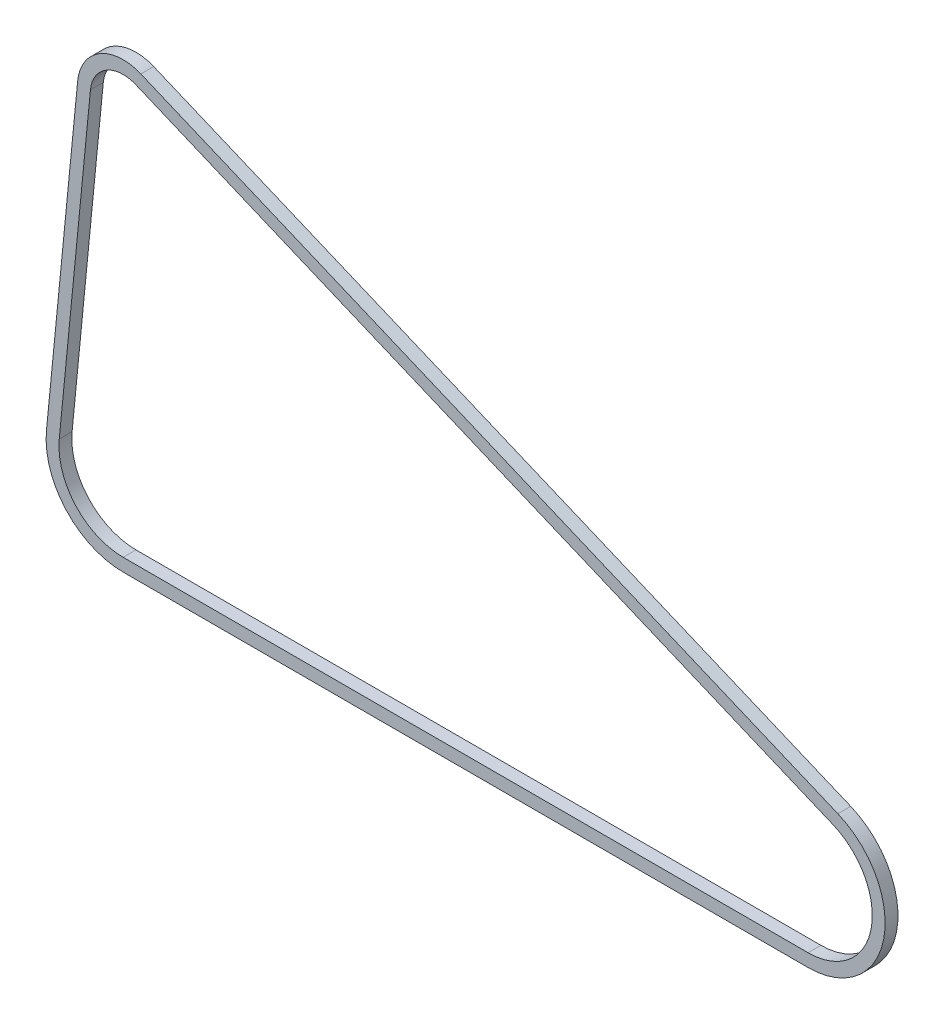
ISO-10303-21;
HEADER;
FILE_DESCRIPTION(('STEP AP214'),'2;1');
FILE_NAME('part.step','',(''),(''),'','','');
FILE_SCHEMA(('AUTOMOTIVE_DESIGN { 1 0 10303 214 1 1 1 1 }'));
ENDSEC;
DATA;
#1=APPLICATION_CONTEXT('core data for automotive mechanical design processes');
#2=APPLICATION_PROTOCOL_DEFINITION('international standard','automotive_design',2000,#1);
#3=PRODUCT_CONTEXT('',#1,'mechanical');
#4=PRODUCT('Part','Part','',(#3));
#5=PRODUCT_RELATED_PRODUCT_CATEGORY('part','',(#4));
#6=PRODUCT_DEFINITION_FORMATION('','',#4);
#7=PRODUCT_DEFINITION_CONTEXT('part definition',#1,'design');
#8=PRODUCT_DEFINITION('design','',#6,#7);
#9=PRODUCT_DEFINITION_SHAPE('','',#8);
#10=(LENGTH_UNIT() NAMED_UNIT(*) SI_UNIT(.MILLI.,.METRE.));
#11=(NAMED_UNIT(*) PLANE_ANGLE_UNIT() SI_UNIT($,.RADIAN.));
#12=(NAMED_UNIT(*) SI_UNIT($,.STERADIAN.) SOLID_ANGLE_UNIT());
#13=UNCERTAINTY_MEASURE_WITH_UNIT(LENGTH_MEASURE(1.E-05),#10,'distance_accuracy_value','');
#14=(GEOMETRIC_REPRESENTATION_CONTEXT(3) GLOBAL_UNCERTAINTY_ASSIGNED_CONTEXT((#13)) GLOBAL_UNIT_ASSIGNED_CONTEXT((#10,
#11,#12)) REPRESENTATION_CONTEXT('',''));
#15=CARTESIAN_POINT('',(0.,0.,0.));
#16=DIRECTION('',(0.,0.,1.));
#17=DIRECTION('',(1.,0.,0.));
#18=AXIS2_PLACEMENT_3D('',#15,#16,#17);
#19=CARTESIAN_POINT('',(4.63778321302399E-12,0.,1.27));
#20=DIRECTION('',(0.,0.,1.));
#21=DIRECTION('',(1.,0.,0.));
#22=AXIS2_PLACEMENT_3D('',#19,#20,#21);
#23=PLANE('',#22);
#24=CARTESIAN_POINT('',(4.63778321302399E-12,0.,1.27));
#25=DIRECTION('',(0.,0.,1.));
#26=DIRECTION('',(1.,0.,0.));
#27=AXIS2_PLACEMENT_3D('',#24,#25,#26);
#28=CIRCLE('',#27,15.24);
#29=CARTESIAN_POINT('',(-4.08006961549745E-12,-15.24,1.27));
#30=VERTEX_POINT('',#29);
#31=CARTESIAN_POINT('',(5.89096621383731,14.0553945895333,1.27));
#32=VERTEX_POINT('',#31);
#33=EDGE_CURVE('E174',#30,#32,#28,.T.);
#34=ORIENTED_EDGE('',*,*,#33,.T.);
#35=DIRECTION('',(-0.922269986189599,0.386546339490929,0.));
#36=VECTOR('',#35,1.);
#37=CARTESIAN_POINT('',(5.89096621383731,14.0553945895333,1.27));
#38=LINE('',#37,#36);
#39=CARTESIAN_POINT('',(-131.972287757669,71.837320675154,1.27));
#40=VERTEX_POINT('',#39);
#41=EDGE_CURVE('E177',#32,#40,#38,.T.);
#42=ORIENTED_EDGE('',*,*,#41,.T.);
#43=CARTESIAN_POINT('',(-135.466666666667,63.5,1.27));
#44=DIRECTION('',(0.,0.,1.));
#45=DIRECTION('',(1.,0.,0.));
#46=AXIS2_PLACEMENT_3D('',#43,#44,#45);
#47=CIRCLE('',#46,9.04);
#48=CARTESIAN_POINT('',(-144.46347369041,64.3826456692913,1.27));
#49=VERTEX_POINT('',#48);
#50=EDGE_CURVE('E180',#40,#49,#47,.T.);
#51=ORIENTED_EDGE('',*,*,#50,.T.);
#52=DIRECTION('',(-0.0976377952755901,-0.995222015900835,0.));
#53=VECTOR('',#52,1.);
#54=CARTESIAN_POINT('',(-144.46347369041,64.3826456692913,1.27));
#55=LINE('',#54,#53);
#56=CARTESIAN_POINT('',(-150.633850188995,1.48799999999999,1.27));
#57=VERTEX_POINT('',#56);
#58=EDGE_CURVE('E182',#49,#57,#55,.T.);
#59=ORIENTED_EDGE('',*,*,#58,.T.);
#60=CARTESIAN_POINT('',(-135.466666666667,0.,1.27));
#61=DIRECTION('',(0.,0.,1.));
#62=DIRECTION('',(1.,0.,0.));
#63=AXIS2_PLACEMENT_3D('',#60,#61,#62);
#64=CIRCLE('',#63,15.24);
#65=CARTESIAN_POINT('',(-135.466666666666,-15.24,1.27));
#66=VERTEX_POINT('',#65);
#67=EDGE_CURVE('E184',#57,#66,#64,.T.);
#68=ORIENTED_EDGE('',*,*,#67,.T.);
#69=DIRECTION('',(1.,0.,0.));
#70=VECTOR('',#69,1.);
#71=CARTESIAN_POINT('',(-135.466666666666,-15.24,1.27));
#72=LINE('',#71,#70);
#73=EDGE_CURVE('E186',#66,#30,#72,.T.);
#74=ORIENTED_EDGE('',*,*,#73,.T.);
#75=EDGE_LOOP('',(#34,#42,#51,#59,#68,#74));
#76=FACE_BOUND('',#75,.T.);
#77=DIRECTION('',(-0.0976377952755901,-0.995222015900835,0.));
#78=VECTOR('',#77,1.);
#79=CARTESIAN_POINT('',(-141.935609770022,64.1346456692913,1.27));
#80=LINE('',#79,#78);
#81=CARTESIAN_POINT('',(-141.935609770022,64.1346456692913,1.27));
#82=VERTEX_POINT('',#81);
#83=CARTESIAN_POINT('',(-148.105986268607,1.23999999999999,1.27));
#84=VERTEX_POINT('',#83);
#85=EDGE_CURVE('E131',#82,#84,#80,.T.);
#86=ORIENTED_EDGE('',*,*,#85,.F.);
#87=CARTESIAN_POINT('',(-135.466666666667,63.5,1.27));
#88=DIRECTION('',(0.,0.,1.));
#89=DIRECTION('',(1.,0.,0.));
#90=AXIS2_PLACEMENT_3D('',#87,#88,#89);
#91=CIRCLE('',#90,6.50000000000001);
#92=CARTESIAN_POINT('',(-132.954115459976,69.4947549102324,1.27));
#93=VERTEX_POINT('',#92);
#94=EDGE_CURVE('E123',#93,#82,#91,.T.);
#95=ORIENTED_EDGE('',*,*,#94,.F.);
#96=DIRECTION('',(-0.922269986189599,0.386546339490929,0.));
#97=VECTOR('',#96,1.);
#98=CARTESIAN_POINT('',(4.90913851153035,11.7128288246117,1.27));
#99=LINE('',#98,#97);
#100=CARTESIAN_POINT('',(4.90913851153035,11.7128288246117,1.27));
#101=VERTEX_POINT('',#100);
#102=EDGE_CURVE('E152',#101,#93,#99,.T.);
#103=ORIENTED_EDGE('',*,*,#102,.F.);
#104=CARTESIAN_POINT('',(4.63778321302399E-12,0.,1.27));
#105=DIRECTION('',(0.,0.,1.));
#106=DIRECTION('',(1.,0.,0.));
#107=AXIS2_PLACEMENT_3D('',#104,#105,#106);
#108=CIRCLE('',#107,12.7);
#109=CARTESIAN_POINT('',(-4.09516596909667E-12,-12.7,1.27));
#110=VERTEX_POINT('',#109);
#111=EDGE_CURVE('E150',#110,#101,#108,.T.);
#112=ORIENTED_EDGE('',*,*,#111,.F.);
#113=DIRECTION('',(1.,0.,0.));
#114=VECTOR('',#113,1.);
#115=CARTESIAN_POINT('',(-135.466666666666,-12.7,1.27));
#116=LINE('',#115,#114);
#117=CARTESIAN_POINT('',(-135.466666666666,-12.7,1.27));
#118=VERTEX_POINT('',#117);
#119=EDGE_CURVE('E146',#118,#110,#116,.T.);
#120=ORIENTED_EDGE('',*,*,#119,.F.);
#121=CARTESIAN_POINT('',(-135.466666666667,0.,1.27));
#122=DIRECTION('',(0.,0.,1.));
#123=DIRECTION('',(1.,0.,0.));
#124=AXIS2_PLACEMENT_3D('',#121,#122,#123);
#125=CIRCLE('',#124,12.7);
#126=EDGE_CURVE('E144',#84,#118,#125,.T.);
#127=ORIENTED_EDGE('',*,*,#126,.F.);
#128=EDGE_LOOP('',(#86,#95,#103,#112,#120,#127));
#129=FACE_BOUND('',#128,.T.);
#130=ADVANCED_FACE('F34',(#76,#129),#23,.T.);
#131=CARTESIAN_POINT('',(4.63778321302399E-12,0.,-1.27));
#132=DIRECTION('',(0.,0.,1.));
#133=DIRECTION('',(1.,0.,0.));
#134=AXIS2_PLACEMENT_3D('',#131,#132,#133);
#135=PLANE('',#134);
#136=CARTESIAN_POINT('',(4.63778321302399E-12,0.,-1.27));
#137=DIRECTION('',(0.,0.,1.));
#138=DIRECTION('',(1.,0.,0.));
#139=AXIS2_PLACEMENT_3D('',#136,#137,#138);
#140=CIRCLE('',#139,15.24);
#141=CARTESIAN_POINT('',(-4.08006961549745E-12,-15.24,-1.27));
#142=VERTEX_POINT('',#141);
#143=CARTESIAN_POINT('',(5.89096621383731,14.0553945895333,-1.27));
#144=VERTEX_POINT('',#143);
#145=EDGE_CURVE('E139',#142,#144,#140,.T.);
#146=ORIENTED_EDGE('',*,*,#145,.F.);
#147=DIRECTION('',(1.,0.,0.));
#148=VECTOR('',#147,1.);
#149=CARTESIAN_POINT('',(-135.466666666666,-15.24,-1.27));
#150=LINE('',#149,#148);
#151=CARTESIAN_POINT('',(-135.466666666666,-15.24,-1.27));
#152=VERTEX_POINT('',#151);
#153=EDGE_CURVE('E178',#152,#142,#150,.T.);
#154=ORIENTED_EDGE('',*,*,#153,.F.);
#155=CARTESIAN_POINT('',(-135.466666666667,0.,-1.27));
#156=DIRECTION('',(0.,0.,1.));
#157=DIRECTION('',(1.,0.,0.));
#158=AXIS2_PLACEMENT_3D('',#155,#156,#157);
#159=CIRCLE('',#158,15.24);
#160=CARTESIAN_POINT('',(-150.633850188995,1.48799999999999,-1.27));
#161=VERTEX_POINT('',#160);
#162=EDGE_CURVE('E197',#161,#152,#159,.T.);
#163=ORIENTED_EDGE('',*,*,#162,.F.);
#164=DIRECTION('',(-0.0976377952755901,-0.995222015900835,0.));
#165=VECTOR('',#164,1.);
#166=CARTESIAN_POINT('',(-144.46347369041,64.3826456692913,-1.27));
#167=LINE('',#166,#165);
#168=CARTESIAN_POINT('',(-144.46347369041,64.3826456692913,-1.27));
#169=VERTEX_POINT('',#168);
#170=EDGE_CURVE('E195',#169,#161,#167,.T.);
#171=ORIENTED_EDGE('',*,*,#170,.F.);
#172=CARTESIAN_POINT('',(-135.466666666667,63.5,-1.27));
#173=DIRECTION('',(0.,0.,1.));
#174=DIRECTION('',(1.,0.,0.));
#175=AXIS2_PLACEMENT_3D('',#172,#173,#174);
#176=CIRCLE('',#175,9.04);
#177=CARTESIAN_POINT('',(-131.972287757669,71.837320675154,-1.27));
#178=VERTEX_POINT('',#177);
#179=EDGE_CURVE('E193',#178,#169,#176,.T.);
#180=ORIENTED_EDGE('',*,*,#179,.F.);
#181=DIRECTION('',(-0.922269986189599,0.386546339490929,0.));
#182=VECTOR('',#181,1.);
#183=CARTESIAN_POINT('',(5.89096621383731,14.0553945895333,-1.27));
#184=LINE('',#183,#182);
#185=EDGE_CURVE('E191',#144,#178,#184,.T.);
#186=ORIENTED_EDGE('',*,*,#185,.F.);
#187=EDGE_LOOP('',(#146,#154,#163,#171,#180,#186));
#188=FACE_BOUND('',#187,.T.);
#189=CARTESIAN_POINT('',(-135.466666666667,63.5,-1.27));
#190=DIRECTION('',(0.,0.,1.));
#191=DIRECTION('',(1.,0.,0.));
#192=AXIS2_PLACEMENT_3D('',#189,#190,#191);
#193=CIRCLE('',#192,6.50000000000001);
#194=CARTESIAN_POINT('',(-132.954115459976,69.4947549102324,-1.27));
#195=VERTEX_POINT('',#194);
#196=CARTESIAN_POINT('',(-141.935609770022,64.1346456692913,-1.27));
#197=VERTEX_POINT('',#196);
#198=EDGE_CURVE('E57',#195,#197,#193,.T.);
#199=ORIENTED_EDGE('',*,*,#198,.T.);
#200=DIRECTION('',(-0.0976377952755901,-0.995222015900835,0.));
#201=VECTOR('',#200,1.);
#202=CARTESIAN_POINT('',(-141.935609770022,64.1346456692913,-1.27));
#203=LINE('',#202,#201);
#204=CARTESIAN_POINT('',(-148.105986268607,1.23999999999999,-1.27));
#205=VERTEX_POINT('',#204);
#206=EDGE_CURVE('E138',#197,#205,#203,.T.);
#207=ORIENTED_EDGE('',*,*,#206,.T.);
#208=CARTESIAN_POINT('',(-135.466666666667,0.,-1.27));
#209=DIRECTION('',(0.,0.,1.));
#210=DIRECTION('',(1.,0.,0.));
#211=AXIS2_PLACEMENT_3D('',#208,#209,#210);
#212=CIRCLE('',#211,12.7);
#213=CARTESIAN_POINT('',(-135.466666666666,-12.7,-1.27));
#214=VERTEX_POINT('',#213);
#215=EDGE_CURVE('E156',#205,#214,#212,.T.);
#216=ORIENTED_EDGE('',*,*,#215,.T.);
#217=DIRECTION('',(1.,0.,0.));
#218=VECTOR('',#217,1.);
#219=CARTESIAN_POINT('',(-135.466666666666,-12.7,-1.27));
#220=LINE('',#219,#218);
#221=CARTESIAN_POINT('',(-4.09516596909667E-12,-12.7,-1.27));
#222=VERTEX_POINT('',#221);
#223=EDGE_CURVE('E159',#214,#222,#220,.T.);
#224=ORIENTED_EDGE('',*,*,#223,.T.);
#225=CARTESIAN_POINT('',(4.63778321302399E-12,0.,-1.27));
#226=DIRECTION('',(0.,0.,1.));
#227=DIRECTION('',(1.,0.,0.));
#228=AXIS2_PLACEMENT_3D('',#225,#226,#227);
#229=CIRCLE('',#228,12.7);
#230=CARTESIAN_POINT('',(4.90913851153035,11.7128288246117,-1.27));
#231=VERTEX_POINT('',#230);
#232=EDGE_CURVE('E162',#222,#231,#229,.T.);
#233=ORIENTED_EDGE('',*,*,#232,.T.);
#234=DIRECTION('',(-0.922269986189599,0.386546339490929,0.));
#235=VECTOR('',#234,1.);
#236=CARTESIAN_POINT('',(4.90913851153035,11.7128288246117,-1.27));
#237=LINE('',#236,#235);
#238=EDGE_CURVE('E132',#231,#195,#237,.T.);
#239=ORIENTED_EDGE('',*,*,#238,.T.);
#240=EDGE_LOOP('',(#199,#207,#216,#224,#233,#239));
#241=FACE_BOUND('',#240,.T.);
#242=ADVANCED_FACE('F221',(#188,#241),#135,.F.);
#243=CARTESIAN_POINT('',(4.63778321302399E-12,0.,1.27));
#244=DIRECTION('',(0.,0.,-1.));
#245=DIRECTION('',(-1.,0.,0.));
#246=AXIS2_PLACEMENT_3D('',#243,#244,#245);
#247=CYLINDRICAL_SURFACE('',#246,15.24);
#248=ORIENTED_EDGE('',*,*,#145,.T.);
#249=DIRECTION('',(0.,0.,-1.));
#250=VECTOR('',#249,1.);
#251=CARTESIAN_POINT('',(5.89096621383731,14.0553945895333,1.27));
#252=LINE('',#251,#250);
#253=EDGE_CURVE('E11',#32,#144,#252,.T.);
#254=ORIENTED_EDGE('',*,*,#253,.F.);
#255=ORIENTED_EDGE('',*,*,#33,.F.);
#256=DIRECTION('',(0.,0.,-1.));
#257=VECTOR('',#256,1.);
#258=CARTESIAN_POINT('',(-4.08006961549745E-12,-15.24,1.27));
#259=LINE('',#258,#257);
#260=EDGE_CURVE('E188',#30,#142,#259,.T.);
#261=ORIENTED_EDGE('',*,*,#260,.T.);
#262=EDGE_LOOP('',(#248,#254,#255,#261));
#263=FACE_BOUND('',#262,.T.);
#264=ADVANCED_FACE('F36',(#263),#247,.T.);
#265=CARTESIAN_POINT('',(5.89096621383731,14.0553945895333,1.27));
#266=DIRECTION('',(-0.386546339490929,-0.922269986189599,0.));
#267=DIRECTION('',(0.922269986189599,-0.386546339490929,0.));
#268=AXIS2_PLACEMENT_3D('',#265,#266,#267);
#269=PLANE('',#268);
#270=ORIENTED_EDGE('',*,*,#185,.T.);
#271=DIRECTION('',(0.,0.,-1.));
#272=VECTOR('',#271,1.);
#273=CARTESIAN_POINT('',(-131.972287757669,71.837320675154,1.27));
#274=LINE('',#273,#272);
#275=EDGE_CURVE('E42',#40,#178,#274,.T.);
#276=ORIENTED_EDGE('',*,*,#275,.F.);
#277=ORIENTED_EDGE('',*,*,#41,.F.);
#278=ORIENTED_EDGE('',*,*,#253,.T.);
#279=EDGE_LOOP('',(#270,#276,#277,#278));
#280=FACE_BOUND('',#279,.T.);
#281=ADVANCED_FACE('F238',(#280),#269,.F.);
#282=CARTESIAN_POINT('',(-135.466666666667,63.5,1.27));
#283=DIRECTION('',(0.,0.,-1.));
#284=DIRECTION('',(-1.,0.,0.));
#285=AXIS2_PLACEMENT_3D('',#282,#283,#284);
#286=CYLINDRICAL_SURFACE('',#285,9.04);
#287=ORIENTED_EDGE('',*,*,#179,.T.);
#288=DIRECTION('',(0.,0.,-1.));
#289=VECTOR('',#288,1.);
#290=CARTESIAN_POINT('',(-144.46347369041,64.3826456692913,1.27));
#291=LINE('',#290,#289);
#292=EDGE_CURVE('E208',#49,#169,#291,.T.);
#293=ORIENTED_EDGE('',*,*,#292,.F.);
#294=ORIENTED_EDGE('',*,*,#50,.F.);
#295=ORIENTED_EDGE('',*,*,#275,.T.);
#296=EDGE_LOOP('',(#287,#293,#294,#295));
#297=FACE_BOUND('',#296,.T.);
#298=ADVANCED_FACE('F215',(#297),#286,.T.);
#299=CARTESIAN_POINT('',(-144.46347369041,64.3826456692913,1.27));
#300=DIRECTION('',(0.995222015900835,-0.0976377952755901,0.));
#301=DIRECTION('',(0.0976377952755901,0.995222015900835,0.));
#302=AXIS2_PLACEMENT_3D('',#299,#300,#301);
#303=PLANE('',#302);
#304=ORIENTED_EDGE('',*,*,#170,.T.);
#305=DIRECTION('',(0.,0.,-1.));
#306=VECTOR('',#305,1.);
#307=CARTESIAN_POINT('',(-150.633850188995,1.48799999999999,1.27));
#308=LINE('',#307,#306);
#309=EDGE_CURVE('E205',#57,#161,#308,.T.);
#310=ORIENTED_EDGE('',*,*,#309,.F.);
#311=ORIENTED_EDGE('',*,*,#58,.F.);
#312=ORIENTED_EDGE('',*,*,#292,.T.);
#313=EDGE_LOOP('',(#304,#310,#311,#312));
#314=FACE_BOUND('',#313,.T.);
#315=ADVANCED_FACE('F227',(#314),#303,.F.);
#316=CARTESIAN_POINT('',(-135.466666666667,0.,1.27));
#317=DIRECTION('',(0.,0.,-1.));
#318=DIRECTION('',(-1.,0.,0.));
#319=AXIS2_PLACEMENT_3D('',#316,#317,#318);
#320=CYLINDRICAL_SURFACE('',#319,15.24);
#321=ORIENTED_EDGE('',*,*,#162,.T.);
#322=DIRECTION('',(0.,0.,-1.));
#323=VECTOR('',#322,1.);
#324=CARTESIAN_POINT('',(-135.466666666666,-15.24,1.27));
#325=LINE('',#324,#323);
#326=EDGE_CURVE('E202',#66,#152,#325,.T.);
#327=ORIENTED_EDGE('',*,*,#326,.F.);
#328=ORIENTED_EDGE('',*,*,#67,.F.);
#329=ORIENTED_EDGE('',*,*,#309,.T.);
#330=EDGE_LOOP('',(#321,#327,#328,#329));
#331=FACE_BOUND('',#330,.T.);
#332=ADVANCED_FACE('F231',(#331),#320,.T.);
#333=CARTESIAN_POINT('',(-135.466666666666,-15.24,1.27));
#334=DIRECTION('',(0.,1.,0.));
#335=DIRECTION('',(-1.,0.,0.));
#336=AXIS2_PLACEMENT_3D('',#333,#334,#335);
#337=PLANE('',#336);
#338=ORIENTED_EDGE('',*,*,#153,.T.);
#339=ORIENTED_EDGE('',*,*,#260,.F.);
#340=ORIENTED_EDGE('',*,*,#73,.F.);
#341=ORIENTED_EDGE('',*,*,#326,.T.);
#342=EDGE_LOOP('',(#338,#339,#340,#341));
#343=FACE_BOUND('',#342,.T.);
#344=ADVANCED_FACE('F241',(#343),#337,.F.);
#345=CARTESIAN_POINT('',(-135.466666666667,63.5,1.27));
#346=DIRECTION('',(0.,0.,-1.));
#347=DIRECTION('',(-1.,0.,0.));
#348=AXIS2_PLACEMENT_3D('',#345,#346,#347);
#349=CYLINDRICAL_SURFACE('',#348,6.50000000000001);
#350=ORIENTED_EDGE('',*,*,#198,.F.);
#351=DIRECTION('',(0.,0.,-1.));
#352=VECTOR('',#351,1.);
#353=CARTESIAN_POINT('',(-132.954115459976,69.4947549102324,1.27));
#354=LINE('',#353,#352);
#355=EDGE_CURVE('E127',#93,#195,#354,.T.);
#356=ORIENTED_EDGE('',*,*,#355,.F.);
#357=ORIENTED_EDGE('',*,*,#94,.T.);
#358=DIRECTION('',(0.,0.,-1.));
#359=VECTOR('',#358,1.);
#360=CARTESIAN_POINT('',(-141.935609770022,64.1346456692913,1.27));
#361=LINE('',#360,#359);
#362=EDGE_CURVE('E126',#82,#197,#361,.T.);
#363=ORIENTED_EDGE('',*,*,#362,.T.);
#364=EDGE_LOOP('',(#350,#356,#357,#363));
#365=FACE_BOUND('',#364,.T.);
#366=ADVANCED_FACE('F125',(#365),#349,.F.);
#367=CARTESIAN_POINT('',(-141.935609770022,64.1346456692913,1.27));
#368=DIRECTION('',(0.995222015900835,-0.0976377952755901,0.));
#369=DIRECTION('',(0.0976377952755901,0.995222015900835,0.));
#370=AXIS2_PLACEMENT_3D('',#367,#368,#369);
#371=PLANE('',#370);
#372=ORIENTED_EDGE('',*,*,#206,.F.);
#373=ORIENTED_EDGE('',*,*,#362,.F.);
#374=ORIENTED_EDGE('',*,*,#85,.T.);
#375=DIRECTION('',(0.,0.,-1.));
#376=VECTOR('',#375,1.);
#377=CARTESIAN_POINT('',(-148.105986268607,1.23999999999999,1.27));
#378=LINE('',#377,#376);
#379=EDGE_CURVE('E140',#84,#205,#378,.T.);
#380=ORIENTED_EDGE('',*,*,#379,.T.);
#381=EDGE_LOOP('',(#372,#373,#374,#380));
#382=FACE_BOUND('',#381,.T.);
#383=ADVANCED_FACE('F135',(#382),#371,.T.);
#384=CARTESIAN_POINT('',(-135.466666666667,0.,1.27));
#385=DIRECTION('',(0.,0.,-1.));
#386=DIRECTION('',(-1.,0.,0.));
#387=AXIS2_PLACEMENT_3D('',#384,#385,#386);
#388=CYLINDRICAL_SURFACE('',#387,12.7);
#389=ORIENTED_EDGE('',*,*,#215,.F.);
#390=ORIENTED_EDGE('',*,*,#379,.F.);
#391=ORIENTED_EDGE('',*,*,#126,.T.);
#392=DIRECTION('',(0.,0.,-1.));
#393=VECTOR('',#392,1.);
#394=CARTESIAN_POINT('',(-135.466666666666,-12.7,1.27));
#395=LINE('',#394,#393);
#396=EDGE_CURVE('E171',#118,#214,#395,.T.);
#397=ORIENTED_EDGE('',*,*,#396,.T.);
#398=EDGE_LOOP('',(#389,#390,#391,#397));
#399=FACE_BOUND('',#398,.T.);
#400=ADVANCED_FACE('F259',(#399),#388,.F.);
#401=CARTESIAN_POINT('',(-135.466666666666,-12.7,1.27));
#402=DIRECTION('',(0.,1.,0.));
#403=DIRECTION('',(-1.,0.,0.));
#404=AXIS2_PLACEMENT_3D('',#401,#402,#403);
#405=PLANE('',#404);
#406=ORIENTED_EDGE('',*,*,#223,.F.);
#407=ORIENTED_EDGE('',*,*,#396,.F.);
#408=ORIENTED_EDGE('',*,*,#119,.T.);
#409=DIRECTION('',(0.,0.,-1.));
#410=VECTOR('',#409,1.);
#411=CARTESIAN_POINT('',(-4.09516596909667E-12,-12.7,1.27));
#412=LINE('',#411,#410);
#413=EDGE_CURVE('E169',#110,#222,#412,.T.);
#414=ORIENTED_EDGE('',*,*,#413,.T.);
#415=EDGE_LOOP('',(#406,#407,#408,#414));
#416=FACE_BOUND('',#415,.T.);
#417=ADVANCED_FACE('F262',(#416),#405,.T.);
#418=CARTESIAN_POINT('',(4.63778321302399E-12,0.,1.27));
#419=DIRECTION('',(0.,0.,-1.));
#420=DIRECTION('',(-1.,0.,0.));
#421=AXIS2_PLACEMENT_3D('',#418,#419,#420);
#422=CYLINDRICAL_SURFACE('',#421,12.7);
#423=ORIENTED_EDGE('',*,*,#232,.F.);
#424=ORIENTED_EDGE('',*,*,#413,.F.);
#425=ORIENTED_EDGE('',*,*,#111,.T.);
#426=DIRECTION('',(0.,0.,-1.));
#427=VECTOR('',#426,1.);
#428=CARTESIAN_POINT('',(4.90913851153035,11.7128288246117,1.27));
#429=LINE('',#428,#427);
#430=EDGE_CURVE('E49',#101,#231,#429,.T.);
#431=ORIENTED_EDGE('',*,*,#430,.T.);
#432=EDGE_LOOP('',(#423,#424,#425,#431));
#433=FACE_BOUND('',#432,.T.);
#434=ADVANCED_FACE('F266',(#433),#422,.F.);
#435=CARTESIAN_POINT('',(4.90913851153035,11.7128288246117,1.27));
#436=DIRECTION('',(-0.386546339490929,-0.922269986189599,0.));
#437=DIRECTION('',(0.922269986189599,-0.386546339490929,0.));
#438=AXIS2_PLACEMENT_3D('',#435,#436,#437);
#439=PLANE('',#438);
#440=ORIENTED_EDGE('',*,*,#238,.F.);
#441=ORIENTED_EDGE('',*,*,#430,.F.);
#442=ORIENTED_EDGE('',*,*,#102,.T.);
#443=ORIENTED_EDGE('',*,*,#355,.T.);
#444=EDGE_LOOP('',(#440,#441,#442,#443));
#445=FACE_BOUND('',#444,.T.);
#446=ADVANCED_FACE('F270',(#445),#439,.T.);
#447=CLOSED_SHELL('',(#130,#242,#264,#281,#298,#315,#332,#344,#366,#383,#400,#417,#434,#446));
#448=MANIFOLD_SOLID_BREP('B2',#447);
#449=ADVANCED_BREP_SHAPE_REPRESENTATION('',(#18,#448),#14);
#450=SHAPE_DEFINITION_REPRESENTATION(#9,#449);
ENDSEC;
END-ISO-10303-21;
